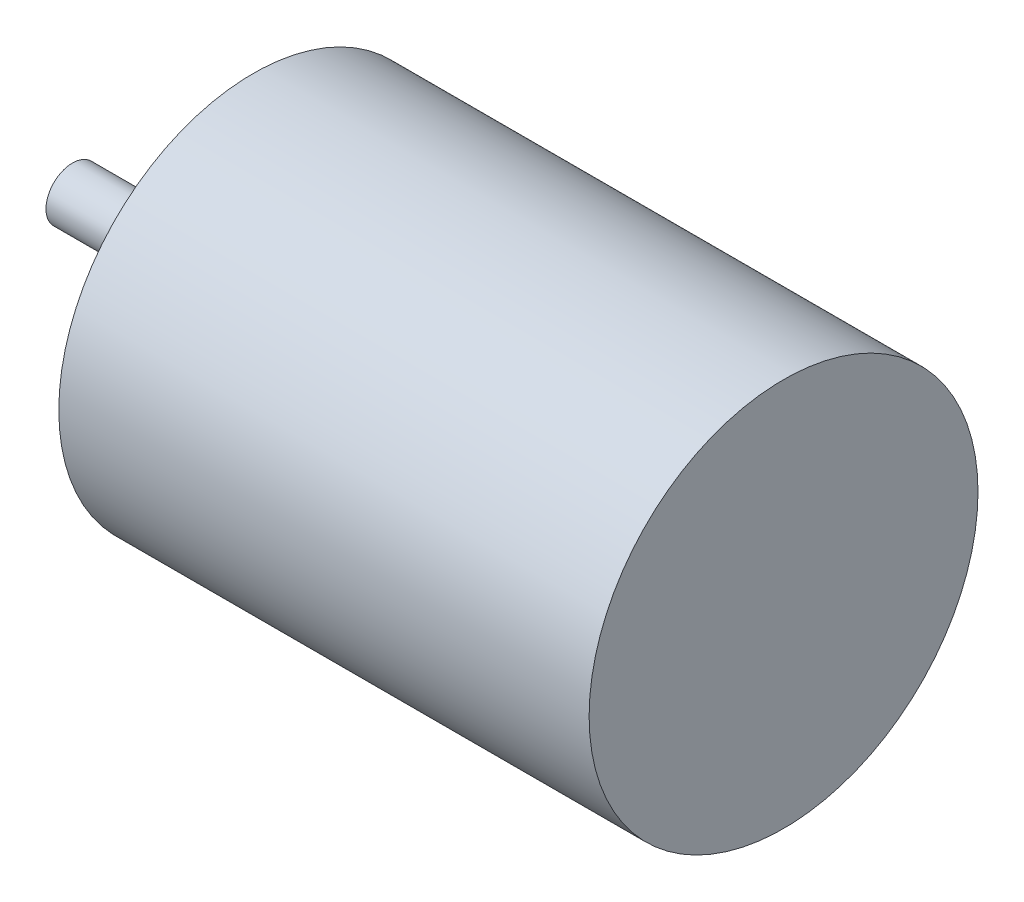
ISO-10303-21;
HEADER;
FILE_DESCRIPTION(('STEP AP214'),'2;1');
FILE_NAME('part.step','',(''),(''),'','','');
FILE_SCHEMA(('AUTOMOTIVE_DESIGN { 1 0 10303 214 1 1 1 1 }'));
ENDSEC;
DATA;
#1=APPLICATION_CONTEXT('core data for automotive mechanical design processes');
#2=APPLICATION_PROTOCOL_DEFINITION('international standard','automotive_design',2000,#1);
#3=PRODUCT_CONTEXT('',#1,'mechanical');
#4=PRODUCT('Part','Part','',(#3));
#5=PRODUCT_RELATED_PRODUCT_CATEGORY('part','',(#4));
#6=PRODUCT_DEFINITION_FORMATION('','',#4);
#7=PRODUCT_DEFINITION_CONTEXT('part definition',#1,'design');
#8=PRODUCT_DEFINITION('design','',#6,#7);
#9=PRODUCT_DEFINITION_SHAPE('','',#8);
#10=(LENGTH_UNIT() NAMED_UNIT(*) SI_UNIT(.MILLI.,.METRE.));
#11=(NAMED_UNIT(*) PLANE_ANGLE_UNIT() SI_UNIT($,.RADIAN.));
#12=(NAMED_UNIT(*) SI_UNIT($,.STERADIAN.) SOLID_ANGLE_UNIT());
#13=UNCERTAINTY_MEASURE_WITH_UNIT(LENGTH_MEASURE(1.E-05),#10,'distance_accuracy_value','');
#14=(GEOMETRIC_REPRESENTATION_CONTEXT(3) GLOBAL_UNCERTAINTY_ASSIGNED_CONTEXT((#13)) GLOBAL_UNIT_ASSIGNED_CONTEXT((#10,
#11,#12)) REPRESENTATION_CONTEXT('',''));
#15=CARTESIAN_POINT('',(0.,0.,0.));
#16=DIRECTION('',(0.,0.,1.));
#17=DIRECTION('',(1.,0.,0.));
#18=AXIS2_PLACEMENT_3D('',#15,#16,#17);
#19=CARTESIAN_POINT('',(357.670794,41.3157017452683,-207.306360518351));
#20=DIRECTION('',(-1.,0.,0.));
#21=DIRECTION('',(0.,0.,1.));
#22=AXIS2_PLACEMENT_3D('',#19,#20,#21);
#23=PLANE('',#22);
#24=CARTESIAN_POINT('',(357.670794,41.3157017452683,-206.556360518351));
#25=DIRECTION('',(-1.,0.,0.));
#26=DIRECTION('',(0.,0.,1.));
#27=AXIS2_PLACEMENT_3D('',#24,#25,#26);
#28=CIRCLE('',#27,1.49999999999997);
#29=CARTESIAN_POINT('',(357.670794,41.3157017452683,-205.056360518351));
#30=VERTEX_POINT('',#29);
#31=EDGE_CURVE('E18',#30,#30,#28,.F.);
#32=ORIENTED_EDGE('',*,*,#31,.F.);
#33=EDGE_LOOP('',(#32));
#34=FACE_BOUND('',#33,.T.);
#35=ADVANCED_FACE('F15',(#34),#23,.T.);
#36=CARTESIAN_POINT('',(362.782855560321,41.3157017452683,-206.556360518351));
#37=DIRECTION('',(-1.,0.,0.));
#38=DIRECTION('',(0.,0.,1.));
#39=AXIS2_PLACEMENT_3D('',#36,#37,#38);
#40=CYLINDRICAL_SURFACE('',#39,1.49999999999997);
#41=ORIENTED_EDGE('',*,*,#31,.T.);
#42=EDGE_LOOP('',(#41));
#43=FACE_BOUND('',#42,.T.);
#44=CARTESIAN_POINT('',(367.894917120642,41.3157017452683,-206.556360518351));
#45=DIRECTION('',(-1.,0.,0.));
#46=DIRECTION('',(0.,0.,1.));
#47=AXIS2_PLACEMENT_3D('',#44,#45,#46);
#48=CIRCLE('',#47,1.49999999999997);
#49=CARTESIAN_POINT('',(367.894917120642,41.3157017452683,-205.056360518351));
#50=VERTEX_POINT('',#49);
#51=EDGE_CURVE('E27',#50,#50,#48,.T.);
#52=ORIENTED_EDGE('',*,*,#51,.T.);
#53=EDGE_LOOP('',(#52));
#54=FACE_BOUND('',#53,.T.);
#55=ADVANCED_FACE('F35',(#43,#54),#40,.T.);
#56=CARTESIAN_POINT('',(397.894917120642,41.3157017452683,-214.056360518351));
#57=DIRECTION('',(1.,0.,0.));
#58=DIRECTION('',(0.,0.,-1.));
#59=AXIS2_PLACEMENT_3D('',#56,#57,#58);
#60=PLANE('',#59);
#61=CARTESIAN_POINT('',(397.894917120642,41.3157017452683,-206.556360518351));
#62=DIRECTION('',(1.,0.,0.));
#63=DIRECTION('',(0.,0.,-1.));
#64=AXIS2_PLACEMENT_3D('',#61,#62,#63);
#65=CIRCLE('',#64,11.);
#66=CARTESIAN_POINT('',(397.894917120642,41.3157017452683,-217.556360518351));
#67=VERTEX_POINT('',#66);
#68=EDGE_CURVE('E22',#67,#67,#65,.F.);
#69=ORIENTED_EDGE('',*,*,#68,.F.);
#70=EDGE_LOOP('',(#69));
#71=FACE_BOUND('',#70,.T.);
#72=ADVANCED_FACE('F42',(#71),#60,.T.);
#73=CARTESIAN_POINT('',(367.894917120642,41.3157017452683,-214.806360518351));
#74=DIRECTION('',(1.,0.,0.));
#75=DIRECTION('',(0.,0.,-1.));
#76=AXIS2_PLACEMENT_3D('',#73,#74,#75);
#77=PLANE('',#76);
#78=CARTESIAN_POINT('',(367.894917120642,41.3157017452683,-206.556360518351));
#79=DIRECTION('',(1.,0.,0.));
#80=DIRECTION('',(0.,0.,-1.));
#81=AXIS2_PLACEMENT_3D('',#78,#79,#80);
#82=CIRCLE('',#81,11.);
#83=CARTESIAN_POINT('',(367.894917120642,41.3157017452683,-217.556360518351));
#84=VERTEX_POINT('',#83);
#85=EDGE_CURVE('E10',#84,#84,#82,.T.);
#86=ORIENTED_EDGE('',*,*,#85,.F.);
#87=EDGE_LOOP('',(#86));
#88=FACE_BOUND('',#87,.T.);
#89=ORIENTED_EDGE('',*,*,#51,.F.);
#90=EDGE_LOOP('',(#89));
#91=FACE_BOUND('',#90,.T.);
#92=ADVANCED_FACE('F45',(#88,#91),#77,.F.);
#93=CARTESIAN_POINT('',(382.894917120642,41.3157017452683,-206.556360518351));
#94=DIRECTION('',(1.,0.,0.));
#95=DIRECTION('',(0.,0.,-1.));
#96=AXIS2_PLACEMENT_3D('',#93,#94,#95);
#97=CYLINDRICAL_SURFACE('',#96,11.);
#98=ORIENTED_EDGE('',*,*,#85,.T.);
#99=EDGE_LOOP('',(#98));
#100=FACE_BOUND('',#99,.T.);
#101=ORIENTED_EDGE('',*,*,#68,.T.);
#102=EDGE_LOOP('',(#101));
#103=FACE_BOUND('',#102,.T.);
#104=ADVANCED_FACE('F43',(#100,#103),#97,.T.);
#105=CLOSED_SHELL('',(#35,#55,#72,#92,#104));
#106=MANIFOLD_SOLID_BREP('B1',#105);
#107=ADVANCED_BREP_SHAPE_REPRESENTATION('',(#18,#106),#14);
#108=SHAPE_DEFINITION_REPRESENTATION(#9,#107);
ENDSEC;
END-ISO-10303-21;
